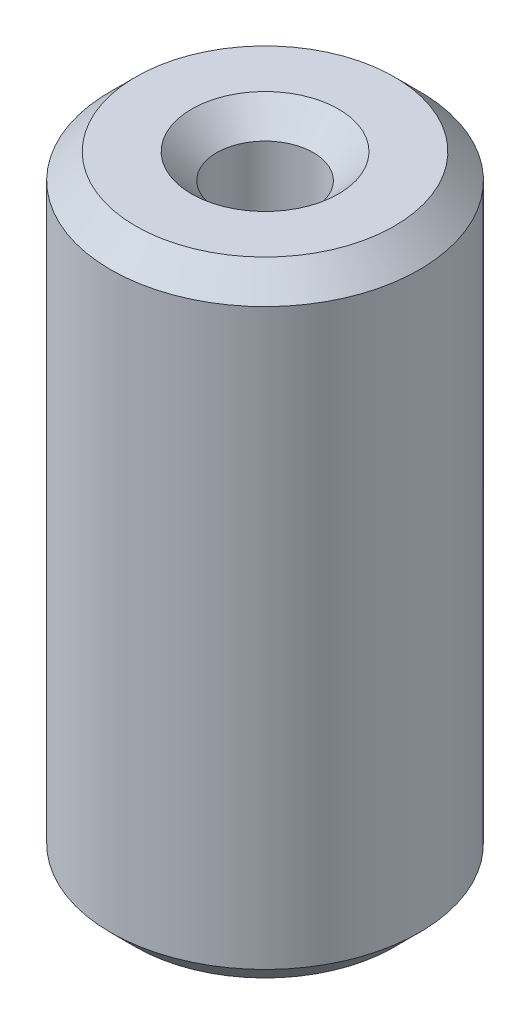
ISO-10303-21;
HEADER;
FILE_DESCRIPTION(('STEP AP214'),'2;1');
FILE_NAME('part.step','',(''),(''),'','','');
FILE_SCHEMA(('AUTOMOTIVE_DESIGN { 1 0 10303 214 1 1 1 1 }'));
ENDSEC;
DATA;
#1=APPLICATION_CONTEXT('core data for automotive mechanical design processes');
#2=APPLICATION_PROTOCOL_DEFINITION('international standard','automotive_design',2000,#1);
#3=PRODUCT_CONTEXT('',#1,'mechanical');
#4=PRODUCT('Part','Part','',(#3));
#5=PRODUCT_RELATED_PRODUCT_CATEGORY('part','',(#4));
#6=PRODUCT_DEFINITION_FORMATION('','',#4);
#7=PRODUCT_DEFINITION_CONTEXT('part definition',#1,'design');
#8=PRODUCT_DEFINITION('design','',#6,#7);
#9=PRODUCT_DEFINITION_SHAPE('','',#8);
#10=(LENGTH_UNIT() NAMED_UNIT(*) SI_UNIT(.MILLI.,.METRE.));
#11=(NAMED_UNIT(*) PLANE_ANGLE_UNIT() SI_UNIT($,.RADIAN.));
#12=(NAMED_UNIT(*) SI_UNIT($,.STERADIAN.) SOLID_ANGLE_UNIT());
#13=UNCERTAINTY_MEASURE_WITH_UNIT(LENGTH_MEASURE(1.E-05),#10,'distance_accuracy_value','');
#14=(GEOMETRIC_REPRESENTATION_CONTEXT(3) GLOBAL_UNCERTAINTY_ASSIGNED_CONTEXT((#13)) GLOBAL_UNIT_ASSIGNED_CONTEXT((#10,
#11,#12)) REPRESENTATION_CONTEXT('',''));
#15=CARTESIAN_POINT('',(0.,0.,0.));
#16=DIRECTION('',(0.,0.,1.));
#17=DIRECTION('',(1.,0.,0.));
#18=AXIS2_PLACEMENT_3D('',#15,#16,#17);
#19=CARTESIAN_POINT('',(0.,20.2130583633035,0.));
#20=DIRECTION('',(0.,-1.,0.));
#21=DIRECTION('',(0.,0.,-1.));
#22=AXIS2_PLACEMENT_3D('',#19,#20,#21);
#23=CYLINDRICAL_SURFACE('',#22,5.);
#24=CARTESIAN_POINT('',(0.,0.814275140971887,0.));
#25=DIRECTION('',(0.,1.,0.));
#26=DIRECTION('',(0.,0.,1.));
#27=AXIS2_PLACEMENT_3D('',#24,#25,#26);
#28=CIRCLE('',#27,5.);
#29=CARTESIAN_POINT('',(0.,0.814275140971887,5.));
#30=VERTEX_POINT('',#29);
#31=EDGE_CURVE('E10',#30,#30,#28,.T.);
#32=ORIENTED_EDGE('',*,*,#31,.T.);
#33=EDGE_LOOP('',(#32));
#34=FACE_BOUND('',#33,.T.);
#35=CARTESIAN_POINT('',(0.,19.3987832223317,0.));
#36=DIRECTION('',(0.,1.,0.));
#37=DIRECTION('',(0.,0.,1.));
#38=AXIS2_PLACEMENT_3D('',#35,#36,#37);
#39=CIRCLE('',#38,5.);
#40=CARTESIAN_POINT('',(0.,19.3987832223317,5.));
#41=VERTEX_POINT('',#40);
#42=EDGE_CURVE('E50',#41,#41,#39,.F.);
#43=ORIENTED_EDGE('',*,*,#42,.T.);
#44=EDGE_LOOP('',(#43));
#45=FACE_BOUND('',#44,.T.);
#46=ADVANCED_FACE('F39',(#34,#45),#23,.T.);
#47=CARTESIAN_POINT('',(0.,20.2130583633035,0.));
#48=DIRECTION('',(0.,1.,0.));
#49=DIRECTION('',(0.,0.,1.));
#50=AXIS2_PLACEMENT_3D('',#47,#48,#49);
#51=PLANE('',#50);
#52=CARTESIAN_POINT('',(0.,20.2130583633035,0.));
#53=DIRECTION('',(0.,1.,0.));
#54=DIRECTION('',(0.,0.,1.));
#55=AXIS2_PLACEMENT_3D('',#52,#53,#54);
#56=CIRCLE('',#55,2.38007031343391);
#57=CARTESIAN_POINT('',(0.,20.2130583633035,2.38007031343391));
#58=VERTEX_POINT('',#57);
#59=EDGE_CURVE('E58',#58,#58,#56,.F.);
#60=ORIENTED_EDGE('',*,*,#59,.T.);
#61=EDGE_LOOP('',(#60));
#62=FACE_BOUND('',#61,.T.);
#63=CARTESIAN_POINT('',(0.,20.2130583633035,0.));
#64=DIRECTION('',(0.,1.,0.));
#65=DIRECTION('',(0.,0.,1.));
#66=AXIS2_PLACEMENT_3D('',#63,#64,#65);
#67=CIRCLE('',#66,4.18572485902812);
#68=CARTESIAN_POINT('',(0.,20.2130583633035,4.18572485902812));
#69=VERTEX_POINT('',#68);
#70=EDGE_CURVE('E61',#69,#69,#67,.T.);
#71=ORIENTED_EDGE('',*,*,#70,.T.);
#72=EDGE_LOOP('',(#71));
#73=FACE_BOUND('',#72,.T.);
#74=ADVANCED_FACE('F88',(#62,#73),#51,.T.);
#75=CARTESIAN_POINT('',(0.,0.,0.));
#76=DIRECTION('',(0.,1.,0.));
#77=DIRECTION('',(0.,0.,1.));
#78=AXIS2_PLACEMENT_3D('',#75,#76,#77);
#79=PLANE('',#78);
#80=CARTESIAN_POINT('',(0.,0.,0.));
#81=DIRECTION('',(0.,1.,0.));
#82=DIRECTION('',(0.,0.,1.));
#83=AXIS2_PLACEMENT_3D('',#80,#81,#82);
#84=CIRCLE('',#83,2.3800703134339);
#85=CARTESIAN_POINT('',(0.,0.,2.3800703134339));
#86=VERTEX_POINT('',#85);
#87=EDGE_CURVE('E51',#86,#86,#84,.T.);
#88=ORIENTED_EDGE('',*,*,#87,.T.);
#89=EDGE_LOOP('',(#88));
#90=FACE_BOUND('',#89,.T.);
#91=CARTESIAN_POINT('',(0.,0.,0.));
#92=DIRECTION('',(0.,1.,0.));
#93=DIRECTION('',(0.,0.,1.));
#94=AXIS2_PLACEMENT_3D('',#91,#92,#93);
#95=CIRCLE('',#94,4.18572485902811);
#96=CARTESIAN_POINT('',(0.,0.,4.18572485902811));
#97=VERTEX_POINT('',#96);
#98=EDGE_CURVE('E54',#97,#97,#95,.F.);
#99=ORIENTED_EDGE('',*,*,#98,.T.);
#100=EDGE_LOOP('',(#99));
#101=FACE_BOUND('',#100,.T.);
#102=ADVANCED_FACE('F83',(#90,#101),#79,.F.);
#103=CARTESIAN_POINT('',(0.,20.2130583633035,0.));
#104=DIRECTION('',(0.,-1.,0.));
#105=DIRECTION('',(0.,0.,-1.));
#106=AXIS2_PLACEMENT_3D('',#103,#104,#105);
#107=CYLINDRICAL_SURFACE('',#106,1.56579517246202);
#108=CARTESIAN_POINT('',(0.,19.3987832223317,0.));
#109=DIRECTION('',(0.,1.,0.));
#110=DIRECTION('',(0.,0.,1.));
#111=AXIS2_PLACEMENT_3D('',#108,#109,#110);
#112=CIRCLE('',#111,1.56579517246202);
#113=CARTESIAN_POINT('',(0.,19.3987832223317,1.56579517246202));
#114=VERTEX_POINT('',#113);
#115=EDGE_CURVE('E67',#114,#114,#112,.T.);
#116=ORIENTED_EDGE('',*,*,#115,.T.);
#117=EDGE_LOOP('',(#116));
#118=FACE_BOUND('',#117,.T.);
#119=CARTESIAN_POINT('',(0.,0.814275140971887,0.));
#120=DIRECTION('',(0.,1.,0.));
#121=DIRECTION('',(0.,0.,1.));
#122=AXIS2_PLACEMENT_3D('',#119,#120,#121);
#123=CIRCLE('',#122,1.56579517246202);
#124=CARTESIAN_POINT('',(0.,0.814275140971887,1.56579517246202));
#125=VERTEX_POINT('',#124);
#126=EDGE_CURVE('E69',#125,#125,#123,.F.);
#127=ORIENTED_EDGE('',*,*,#126,.T.);
#128=EDGE_LOOP('',(#127));
#129=FACE_BOUND('',#128,.T.);
#130=ADVANCED_FACE('F71',(#118,#129),#107,.F.);
#131=CARTESIAN_POINT('',(0.,19.3987832223317,0.));
#132=DIRECTION('',(0.,1.,0.));
#133=DIRECTION('',(0.,0.,1.));
#134=AXIS2_PLACEMENT_3D('',#131,#132,#133);
#135=CONICAL_SURFACE('',#134,1.56579517246202,0.785398163397452);
#136=ORIENTED_EDGE('',*,*,#59,.F.);
#137=EDGE_LOOP('',(#136));
#138=FACE_BOUND('',#137,.T.);
#139=ORIENTED_EDGE('',*,*,#115,.F.);
#140=EDGE_LOOP('',(#139));
#141=FACE_BOUND('',#140,.T.);
#142=ADVANCED_FACE('F77',(#138,#141),#135,.F.);
#143=CARTESIAN_POINT('',(0.,0.,0.));
#144=DIRECTION('',(0.,-1.,0.));
#145=DIRECTION('',(0.,0.,-1.));
#146=AXIS2_PLACEMENT_3D('',#143,#144,#145);
#147=CONICAL_SURFACE('',#146,2.3800703134339,0.785398163397444);
#148=ORIENTED_EDGE('',*,*,#126,.F.);
#149=EDGE_LOOP('',(#148));
#150=FACE_BOUND('',#149,.T.);
#151=ORIENTED_EDGE('',*,*,#87,.F.);
#152=EDGE_LOOP('',(#151));
#153=FACE_BOUND('',#152,.T.);
#154=ADVANCED_FACE('F73',(#150,#153),#147,.F.);
#155=CARTESIAN_POINT('',(0.,0.814275140971887,0.));
#156=DIRECTION('',(0.,1.,0.));
#157=DIRECTION('',(0.,0.,1.));
#158=AXIS2_PLACEMENT_3D('',#155,#156,#157);
#159=CONICAL_SURFACE('',#158,5.,0.785398163397451);
#160=ORIENTED_EDGE('',*,*,#98,.F.);
#161=EDGE_LOOP('',(#160));
#162=FACE_BOUND('',#161,.T.);
#163=ORIENTED_EDGE('',*,*,#31,.F.);
#164=EDGE_LOOP('',(#163));
#165=FACE_BOUND('',#164,.T.);
#166=ADVANCED_FACE('F76',(#162,#165),#159,.T.);
#167=CARTESIAN_POINT('',(0.,20.2130583633035,0.));
#168=DIRECTION('',(0.,-1.,0.));
#169=DIRECTION('',(0.,0.,-1.));
#170=AXIS2_PLACEMENT_3D('',#167,#168,#169);
#171=CONICAL_SURFACE('',#170,4.18572485902812,0.785398163397446);
#172=ORIENTED_EDGE('',*,*,#42,.F.);
#173=EDGE_LOOP('',(#172));
#174=FACE_BOUND('',#173,.T.);
#175=ORIENTED_EDGE('',*,*,#70,.F.);
#176=EDGE_LOOP('',(#175));
#177=FACE_BOUND('',#176,.T.);
#178=ADVANCED_FACE('F45',(#174,#177),#171,.T.);
#179=CLOSED_SHELL('',(#46,#74,#102,#130,#142,#154,#166,#178));
#180=MANIFOLD_SOLID_BREP('B2',#179);
#181=ADVANCED_BREP_SHAPE_REPRESENTATION('',(#18,#180),#14);
#182=SHAPE_DEFINITION_REPRESENTATION(#9,#181);
ENDSEC;
END-ISO-10303-21;
